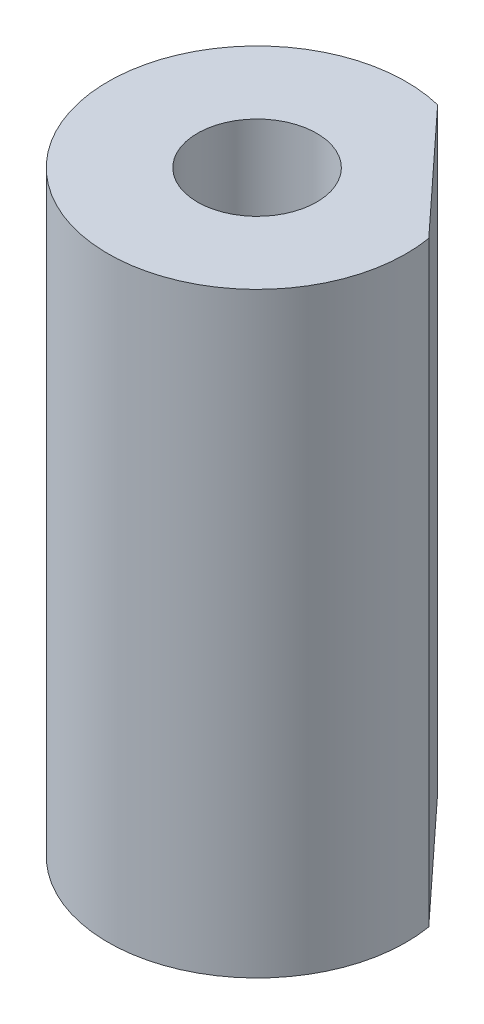
ISO-10303-21;
HEADER;
FILE_DESCRIPTION(('STEP AP214'),'2;1');
FILE_NAME('part.step','',(''),(''),'','','');
FILE_SCHEMA(('AUTOMOTIVE_DESIGN { 1 0 10303 214 1 1 1 1 }'));
ENDSEC;
DATA;
#1=APPLICATION_CONTEXT('core data for automotive mechanical design processes');
#2=APPLICATION_PROTOCOL_DEFINITION('international standard','automotive_design',2000,#1);
#3=PRODUCT_CONTEXT('',#1,'mechanical');
#4=PRODUCT('Part','Part','',(#3));
#5=PRODUCT_RELATED_PRODUCT_CATEGORY('part','',(#4));
#6=PRODUCT_DEFINITION_FORMATION('','',#4);
#7=PRODUCT_DEFINITION_CONTEXT('part definition',#1,'design');
#8=PRODUCT_DEFINITION('design','',#6,#7);
#9=PRODUCT_DEFINITION_SHAPE('','',#8);
#10=(LENGTH_UNIT() NAMED_UNIT(*) SI_UNIT(.MILLI.,.METRE.));
#11=(NAMED_UNIT(*) PLANE_ANGLE_UNIT() SI_UNIT($,.RADIAN.));
#12=(NAMED_UNIT(*) SI_UNIT($,.STERADIAN.) SOLID_ANGLE_UNIT());
#13=UNCERTAINTY_MEASURE_WITH_UNIT(LENGTH_MEASURE(1.E-05),#10,'distance_accuracy_value','');
#14=(GEOMETRIC_REPRESENTATION_CONTEXT(3) GLOBAL_UNCERTAINTY_ASSIGNED_CONTEXT((#13)) GLOBAL_UNIT_ASSIGNED_CONTEXT((#10,
#11,#12)) REPRESENTATION_CONTEXT('',''));
#15=CARTESIAN_POINT('',(0.,0.,0.));
#16=DIRECTION('',(0.,0.,1.));
#17=DIRECTION('',(1.,0.,0.));
#18=AXIS2_PLACEMENT_3D('',#15,#16,#17);
#19=CARTESIAN_POINT('',(0.,50.,0.));
#20=DIRECTION('',(0.,1.,0.));
#21=DIRECTION('',(0.,0.,1.));
#22=AXIS2_PLACEMENT_3D('',#19,#20,#21);
#23=PLANE('',#22);
#24=DIRECTION('',(0.679535924651933,0.,0.733642233726659));
#25=VECTOR('',#24,1.);
#26=CARTESIAN_POINT('',(3.00354867039476,50.,-12.1337832263713));
#27=LINE('',#26,#25);
#28=CARTESIAN_POINT('',(3.00354867039476,50.,-12.1337832263713));
#29=VERTEX_POINT('',#28);
#30=CARTESIAN_POINT('',(12.3279185653379,50.,-2.06698423951325));
#31=VERTEX_POINT('',#30);
#32=EDGE_CURVE('E48',#29,#31,#27,.T.);
#33=ORIENTED_EDGE('',*,*,#32,.F.);
#34=CARTESIAN_POINT('',(0.,50.,0.));
#35=DIRECTION('',(0.,1.,0.));
#36=DIRECTION('',(0.,0.,1.));
#37=AXIS2_PLACEMENT_3D('',#34,#35,#36);
#38=CIRCLE('',#37,12.5);
#39=EDGE_CURVE('E11',#29,#31,#38,.T.);
#40=ORIENTED_EDGE('',*,*,#39,.T.);
#41=EDGE_LOOP('',(#33,#40));
#42=FACE_BOUND('',#41,.T.);
#43=CARTESIAN_POINT('',(0.,50.,0.));
#44=DIRECTION('',(0.,1.,0.));
#45=DIRECTION('',(0.,0.,1.));
#46=AXIS2_PLACEMENT_3D('',#43,#44,#45);
#47=CIRCLE('',#46,5.);
#48=CARTESIAN_POINT('',(0.,50.,5.));
#49=VERTEX_POINT('',#48);
#50=EDGE_CURVE('E72',#49,#49,#47,.T.);
#51=ORIENTED_EDGE('',*,*,#50,.F.);
#52=EDGE_LOOP('',(#51));
#53=FACE_BOUND('',#52,.T.);
#54=ADVANCED_FACE('F33',(#42,#53),#23,.T.);
#55=CARTESIAN_POINT('',(0.,0.,0.));
#56=DIRECTION('',(0.,1.,0.));
#57=DIRECTION('',(0.,0.,1.));
#58=AXIS2_PLACEMENT_3D('',#55,#56,#57);
#59=PLANE('',#58);
#60=CARTESIAN_POINT('',(0.,0.,0.));
#61=DIRECTION('',(0.,1.,0.));
#62=DIRECTION('',(0.,0.,1.));
#63=AXIS2_PLACEMENT_3D('',#60,#61,#62);
#64=CIRCLE('',#63,12.5);
#65=CARTESIAN_POINT('',(3.00354867039476,0.,-12.1337832263713));
#66=VERTEX_POINT('',#65);
#67=CARTESIAN_POINT('',(12.3279185653379,0.,-2.06698423951325));
#68=VERTEX_POINT('',#67);
#69=EDGE_CURVE('E37',#66,#68,#64,.T.);
#70=ORIENTED_EDGE('',*,*,#69,.F.);
#71=DIRECTION('',(0.679535924651933,0.,0.733642233726659));
#72=VECTOR('',#71,1.);
#73=CARTESIAN_POINT('',(3.00354867039476,0.,-12.1337832263713));
#74=LINE('',#73,#72);
#75=EDGE_CURVE('E60',#66,#68,#74,.T.);
#76=ORIENTED_EDGE('',*,*,#75,.T.);
#77=EDGE_LOOP('',(#70,#76));
#78=FACE_BOUND('',#77,.T.);
#79=CARTESIAN_POINT('',(0.,0.,0.));
#80=DIRECTION('',(0.,1.,0.));
#81=DIRECTION('',(0.,0.,1.));
#82=AXIS2_PLACEMENT_3D('',#79,#80,#81);
#83=CIRCLE('',#82,5.);
#84=CARTESIAN_POINT('',(0.,0.,5.));
#85=VERTEX_POINT('',#84);
#86=EDGE_CURVE('E69',#85,#85,#83,.T.);
#87=ORIENTED_EDGE('',*,*,#86,.T.);
#88=EDGE_LOOP('',(#87));
#89=FACE_BOUND('',#88,.T.);
#90=ADVANCED_FACE('F82',(#78,#89),#59,.F.);
#91=CARTESIAN_POINT('',(0.,50.,0.));
#92=DIRECTION('',(0.,-1.,0.));
#93=DIRECTION('',(0.,0.,-1.));
#94=AXIS2_PLACEMENT_3D('',#91,#92,#93);
#95=CYLINDRICAL_SURFACE('',#94,12.5);
#96=ORIENTED_EDGE('',*,*,#39,.F.);
#97=DIRECTION('',(0.,1.,0.));
#98=VECTOR('',#97,1.);
#99=CARTESIAN_POINT('',(3.00354867039476,0.,-12.1337832263713));
#100=LINE('',#99,#98);
#101=EDGE_CURVE('E58',#66,#29,#100,.T.);
#102=ORIENTED_EDGE('',*,*,#101,.F.);
#103=ORIENTED_EDGE('',*,*,#69,.T.);
#104=DIRECTION('',(0.,1.,0.));
#105=VECTOR('',#104,1.);
#106=CARTESIAN_POINT('',(12.3279185653379,0.,-2.06698423951325));
#107=LINE('',#106,#105);
#108=EDGE_CURVE('E53',#68,#31,#107,.T.);
#109=ORIENTED_EDGE('',*,*,#108,.T.);
#110=EDGE_LOOP('',(#96,#102,#103,#109));
#111=FACE_BOUND('',#110,.T.);
#112=ADVANCED_FACE('F35',(#111),#95,.T.);
#113=CARTESIAN_POINT('',(0.,50.,0.));
#114=DIRECTION('',(0.,-1.,0.));
#115=DIRECTION('',(0.,0.,-1.));
#116=AXIS2_PLACEMENT_3D('',#113,#114,#115);
#117=CYLINDRICAL_SURFACE('',#116,5.);
#118=ORIENTED_EDGE('',*,*,#50,.T.);
#119=EDGE_LOOP('',(#118));
#120=FACE_BOUND('',#119,.T.);
#121=ORIENTED_EDGE('',*,*,#86,.F.);
#122=EDGE_LOOP('',(#121));
#123=FACE_BOUND('',#122,.T.);
#124=ADVANCED_FACE('F79',(#120,#123),#117,.F.);
#125=CARTESIAN_POINT('',(3.00354867039476,0.,-12.1337832263713));
#126=DIRECTION('',(-0.73364223372666,0.,0.679535924651933));
#127=DIRECTION('',(0.679535924651933,0.,0.73364223372666));
#128=AXIS2_PLACEMENT_3D('',#125,#126,#127);
#129=PLANE('',#128);
#130=ORIENTED_EDGE('',*,*,#32,.T.);
#131=ORIENTED_EDGE('',*,*,#108,.F.);
#132=ORIENTED_EDGE('',*,*,#75,.F.);
#133=ORIENTED_EDGE('',*,*,#101,.T.);
#134=EDGE_LOOP('',(#130,#131,#132,#133));
#135=FACE_BOUND('',#134,.T.);
#136=ADVANCED_FACE('F59',(#135),#129,.F.);
#137=CLOSED_SHELL('',(#54,#90,#112,#124,#136));
#138=MANIFOLD_SOLID_BREP('B2',#137);
#139=ADVANCED_BREP_SHAPE_REPRESENTATION('',(#18,#138),#14);
#140=SHAPE_DEFINITION_REPRESENTATION(#9,#139);
ENDSEC;
END-ISO-10303-21;
